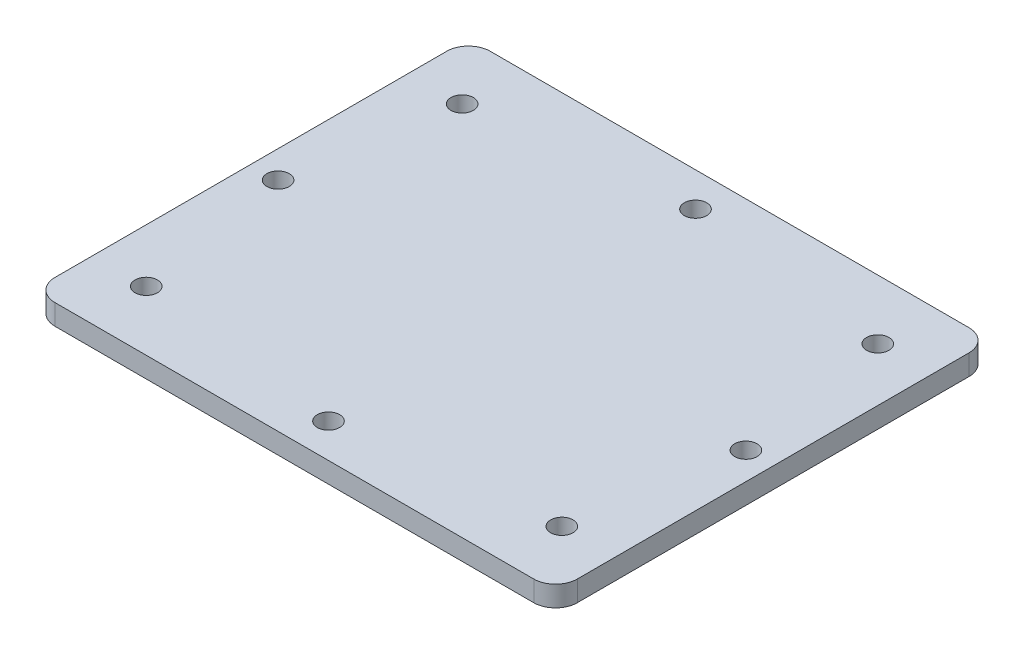
ISO-10303-21;
HEADER;
FILE_DESCRIPTION(('STEP AP214'),'2;1');
FILE_NAME('part.step','',(''),(''),'','','');
FILE_SCHEMA(('AUTOMOTIVE_DESIGN { 1 0 10303 214 1 1 1 1 }'));
ENDSEC;
DATA;
#1=APPLICATION_CONTEXT('core data for automotive mechanical design processes');
#2=APPLICATION_PROTOCOL_DEFINITION('international standard','automotive_design',2000,#1);
#3=PRODUCT_CONTEXT('',#1,'mechanical');
#4=PRODUCT('Part','Part','',(#3));
#5=PRODUCT_RELATED_PRODUCT_CATEGORY('part','',(#4));
#6=PRODUCT_DEFINITION_FORMATION('','',#4);
#7=PRODUCT_DEFINITION_CONTEXT('part definition',#1,'design');
#8=PRODUCT_DEFINITION('design','',#6,#7);
#9=PRODUCT_DEFINITION_SHAPE('','',#8);
#10=(LENGTH_UNIT() NAMED_UNIT(*) SI_UNIT(.MILLI.,.METRE.));
#11=(NAMED_UNIT(*) PLANE_ANGLE_UNIT() SI_UNIT($,.RADIAN.));
#12=(NAMED_UNIT(*) SI_UNIT($,.STERADIAN.) SOLID_ANGLE_UNIT());
#13=UNCERTAINTY_MEASURE_WITH_UNIT(LENGTH_MEASURE(1.E-05),#10,'distance_accuracy_value','');
#14=(GEOMETRIC_REPRESENTATION_CONTEXT(3) GLOBAL_UNCERTAINTY_ASSIGNED_CONTEXT((#13)) GLOBAL_UNIT_ASSIGNED_CONTEXT((#10,
#11,#12)) REPRESENTATION_CONTEXT('',''));
#15=CARTESIAN_POINT('',(0.,0.,0.));
#16=DIRECTION('',(0.,0.,1.));
#17=DIRECTION('',(1.,0.,0.));
#18=AXIS2_PLACEMENT_3D('',#15,#16,#17);
#19=CARTESIAN_POINT('',(38.1,1.5,-31.75));
#20=DIRECTION('',(-1.,0.,0.));
#21=DIRECTION('',(0.,0.,1.));
#22=AXIS2_PLACEMENT_3D('',#19,#20,#21);
#23=PLANE('',#22);
#24=DIRECTION('',(0.,0.,-1.));
#25=VECTOR('',#24,1.);
#26=CARTESIAN_POINT('',(38.1,-1.5,-31.75));
#27=LINE('',#26,#25);
#28=CARTESIAN_POINT('',(38.1,-1.5,28.575));
#29=VERTEX_POINT('',#28);
#30=CARTESIAN_POINT('',(38.1,-1.5,-28.575));
#31=VERTEX_POINT('',#30);
#32=EDGE_CURVE('E154',#29,#31,#27,.T.);
#33=ORIENTED_EDGE('',*,*,#32,.T.);
#34=DIRECTION('',(0.,-1.,0.));
#35=VECTOR('',#34,1.);
#36=CARTESIAN_POINT('',(38.1,1.5,-28.575));
#37=LINE('',#36,#35);
#38=CARTESIAN_POINT('',(38.1,1.5,-28.575));
#39=VERTEX_POINT('',#38);
#40=EDGE_CURVE('E188',#31,#39,#37,.F.);
#41=ORIENTED_EDGE('',*,*,#40,.T.);
#42=DIRECTION('',(0.,0.,-1.));
#43=VECTOR('',#42,1.);
#44=CARTESIAN_POINT('',(38.1,1.5,-31.75));
#45=LINE('',#44,#43);
#46=CARTESIAN_POINT('',(38.1,1.5,28.575));
#47=VERTEX_POINT('',#46);
#48=EDGE_CURVE('E152',#47,#39,#45,.T.);
#49=ORIENTED_EDGE('',*,*,#48,.F.);
#50=DIRECTION('',(0.,-1.,0.));
#51=VECTOR('',#50,1.);
#52=CARTESIAN_POINT('',(38.1,1.5,28.575));
#53=LINE('',#52,#51);
#54=EDGE_CURVE('E184',#47,#29,#53,.T.);
#55=ORIENTED_EDGE('',*,*,#54,.T.);
#56=EDGE_LOOP('',(#33,#41,#49,#55));
#57=FACE_BOUND('',#56,.T.);
#58=ADVANCED_FACE('F51',(#57),#23,.F.);
#59=CARTESIAN_POINT('',(-38.1,1.5,-31.75));
#60=DIRECTION('',(0.,0.,1.));
#61=DIRECTION('',(1.,0.,0.));
#62=AXIS2_PLACEMENT_3D('',#59,#60,#61);
#63=PLANE('',#62);
#64=DIRECTION('',(-1.,0.,0.));
#65=VECTOR('',#64,1.);
#66=CARTESIAN_POINT('',(-38.1,-1.5,-31.75));
#67=LINE('',#66,#65);
#68=CARTESIAN_POINT('',(34.925,-1.5,-31.75));
#69=VERTEX_POINT('',#68);
#70=CARTESIAN_POINT('',(-34.925,-1.5,-31.75));
#71=VERTEX_POINT('',#70);
#72=EDGE_CURVE('E148',#69,#71,#67,.T.);
#73=ORIENTED_EDGE('',*,*,#72,.T.);
#74=DIRECTION('',(0.,-1.,0.));
#75=VECTOR('',#74,1.);
#76=CARTESIAN_POINT('',(-34.925,1.5,-31.75));
#77=LINE('',#76,#75);
#78=CARTESIAN_POINT('',(-34.925,1.5,-31.75));
#79=VERTEX_POINT('',#78);
#80=EDGE_CURVE('E124',#71,#79,#77,.F.);
#81=ORIENTED_EDGE('',*,*,#80,.T.);
#82=DIRECTION('',(-1.,0.,0.));
#83=VECTOR('',#82,1.);
#84=CARTESIAN_POINT('',(-38.1,1.5,-31.75));
#85=LINE('',#84,#83);
#86=CARTESIAN_POINT('',(34.925,1.5,-31.75));
#87=VERTEX_POINT('',#86);
#88=EDGE_CURVE('E260',#87,#79,#85,.T.);
#89=ORIENTED_EDGE('',*,*,#88,.F.);
#90=DIRECTION('',(0.,-1.,0.));
#91=VECTOR('',#90,1.);
#92=CARTESIAN_POINT('',(34.925,1.5,-31.75));
#93=LINE('',#92,#91);
#94=EDGE_CURVE('E130',#87,#69,#93,.T.);
#95=ORIENTED_EDGE('',*,*,#94,.T.);
#96=EDGE_LOOP('',(#73,#81,#89,#95));
#97=FACE_BOUND('',#96,.T.);
#98=ADVANCED_FACE('F281',(#97),#63,.F.);
#99=CARTESIAN_POINT('',(-38.1,1.5,-31.75));
#100=DIRECTION('',(1.,0.,0.));
#101=DIRECTION('',(0.,0.,-1.));
#102=AXIS2_PLACEMENT_3D('',#99,#100,#101);
#103=PLANE('',#102);
#104=DIRECTION('',(0.,0.,1.));
#105=VECTOR('',#104,1.);
#106=CARTESIAN_POINT('',(-38.1,1.5,-31.75));
#107=LINE('',#106,#105);
#108=CARTESIAN_POINT('',(-38.1,1.5,-28.575));
#109=VERTEX_POINT('',#108);
#110=CARTESIAN_POINT('',(-38.1,1.5,28.575));
#111=VERTEX_POINT('',#110);
#112=EDGE_CURVE('E139',#109,#111,#107,.T.);
#113=ORIENTED_EDGE('',*,*,#112,.F.);
#114=DIRECTION('',(0.,-1.,0.));
#115=VECTOR('',#114,1.);
#116=CARTESIAN_POINT('',(-38.1,1.5,-28.575));
#117=LINE('',#116,#115);
#118=CARTESIAN_POINT('',(-38.1,-1.5,-28.575));
#119=VERTEX_POINT('',#118);
#120=EDGE_CURVE('E123',#109,#119,#117,.T.);
#121=ORIENTED_EDGE('',*,*,#120,.T.);
#122=DIRECTION('',(0.,0.,1.));
#123=VECTOR('',#122,1.);
#124=CARTESIAN_POINT('',(-38.1,-1.5,-31.75));
#125=LINE('',#124,#123);
#126=CARTESIAN_POINT('',(-38.1,-1.5,28.575));
#127=VERTEX_POINT('',#126);
#128=EDGE_CURVE('E137',#119,#127,#125,.T.);
#129=ORIENTED_EDGE('',*,*,#128,.T.);
#130=DIRECTION('',(0.,-1.,0.));
#131=VECTOR('',#130,1.);
#132=CARTESIAN_POINT('',(-38.1,1.5,28.575));
#133=LINE('',#132,#131);
#134=EDGE_CURVE('E142',#127,#111,#133,.F.);
#135=ORIENTED_EDGE('',*,*,#134,.T.);
#136=EDGE_LOOP('',(#113,#121,#129,#135));
#137=FACE_BOUND('',#136,.T.);
#138=ADVANCED_FACE('F136',(#137),#103,.F.);
#139=CARTESIAN_POINT('',(-38.1,1.5,31.75));
#140=DIRECTION('',(0.,0.,-1.));
#141=DIRECTION('',(-1.,0.,0.));
#142=AXIS2_PLACEMENT_3D('',#139,#140,#141);
#143=PLANE('',#142);
#144=DIRECTION('',(1.,0.,0.));
#145=VECTOR('',#144,1.);
#146=CARTESIAN_POINT('',(-38.1,-1.5,31.75));
#147=LINE('',#146,#145);
#148=CARTESIAN_POINT('',(-34.925,-1.5,31.75));
#149=VERTEX_POINT('',#148);
#150=CARTESIAN_POINT('',(34.925,-1.5,31.75));
#151=VERTEX_POINT('',#150);
#152=EDGE_CURVE('E147',#149,#151,#147,.T.);
#153=ORIENTED_EDGE('',*,*,#152,.T.);
#154=DIRECTION('',(0.,-1.,0.));
#155=VECTOR('',#154,1.);
#156=CARTESIAN_POINT('',(34.925,1.5,31.75));
#157=LINE('',#156,#155);
#158=CARTESIAN_POINT('',(34.925,1.5,31.75));
#159=VERTEX_POINT('',#158);
#160=EDGE_CURVE('E11',#151,#159,#157,.F.);
#161=ORIENTED_EDGE('',*,*,#160,.T.);
#162=DIRECTION('',(1.,0.,0.));
#163=VECTOR('',#162,1.);
#164=CARTESIAN_POINT('',(-38.1,1.5,31.75));
#165=LINE('',#164,#163);
#166=CARTESIAN_POINT('',(-34.925,1.5,31.75));
#167=VERTEX_POINT('',#166);
#168=EDGE_CURVE('E159',#167,#159,#165,.T.);
#169=ORIENTED_EDGE('',*,*,#168,.F.);
#170=DIRECTION('',(0.,-1.,0.));
#171=VECTOR('',#170,1.);
#172=CARTESIAN_POINT('',(-34.925,1.5,31.75));
#173=LINE('',#172,#171);
#174=EDGE_CURVE('E61',#167,#149,#173,.T.);
#175=ORIENTED_EDGE('',*,*,#174,.T.);
#176=EDGE_LOOP('',(#153,#161,#169,#175));
#177=FACE_BOUND('',#176,.T.);
#178=ADVANCED_FACE('F288',(#177),#143,.F.);
#179=CARTESIAN_POINT('',(0.,1.5,0.));
#180=DIRECTION('',(0.,1.,0.));
#181=DIRECTION('',(0.,0.,1.));
#182=AXIS2_PLACEMENT_3D('',#179,#180,#181);
#183=PLANE('',#182);
#184=CARTESIAN_POINT('',(-34.125,1.5,0.));
#185=DIRECTION('',(0.,1.,0.));
#186=DIRECTION('',(0.,0.,1.));
#187=AXIS2_PLACEMENT_3D('',#184,#185,#186);
#188=CIRCLE('',#187,1.63195);
#189=CARTESIAN_POINT('',(-34.125,1.5,1.63195000000001));
#190=VERTEX_POINT('',#189);
#191=EDGE_CURVE('E239',#190,#190,#188,.T.);
#192=ORIENTED_EDGE('',*,*,#191,.F.);
#193=EDGE_LOOP('',(#192));
#194=FACE_BOUND('',#193,.T.);
#195=CARTESIAN_POINT('',(-30.315,1.5,23.045));
#196=DIRECTION('',(0.,1.,0.));
#197=DIRECTION('',(0.,0.,1.));
#198=AXIS2_PLACEMENT_3D('',#195,#196,#197);
#199=CIRCLE('',#198,1.63195);
#200=CARTESIAN_POINT('',(-30.315,1.5,24.67695));
#201=VERTEX_POINT('',#200);
#202=EDGE_CURVE('E226',#201,#201,#199,.T.);
#203=ORIENTED_EDGE('',*,*,#202,.F.);
#204=EDGE_LOOP('',(#203));
#205=FACE_BOUND('',#204,.T.);
#206=CARTESIAN_POINT('',(0.,1.5,26.77));
#207=DIRECTION('',(0.,1.,0.));
#208=DIRECTION('',(0.,0.,1.));
#209=AXIS2_PLACEMENT_3D('',#206,#207,#208);
#210=CIRCLE('',#209,1.63195);
#211=CARTESIAN_POINT('',(0.,1.5,28.40195));
#212=VERTEX_POINT('',#211);
#213=EDGE_CURVE('E222',#212,#212,#210,.T.);
#214=ORIENTED_EDGE('',*,*,#213,.F.);
#215=EDGE_LOOP('',(#214));
#216=FACE_BOUND('',#215,.T.);
#217=CARTESIAN_POINT('',(30.315,1.5,23.045));
#218=DIRECTION('',(0.,1.,0.));
#219=DIRECTION('',(0.,0.,1.));
#220=AXIS2_PLACEMENT_3D('',#217,#218,#219);
#221=CIRCLE('',#220,1.63195);
#222=CARTESIAN_POINT('',(30.315,1.5,24.67695));
#223=VERTEX_POINT('',#222);
#224=EDGE_CURVE('E218',#223,#223,#221,.T.);
#225=ORIENTED_EDGE('',*,*,#224,.F.);
#226=EDGE_LOOP('',(#225));
#227=FACE_BOUND('',#226,.T.);
#228=CARTESIAN_POINT('',(34.125,1.5,0.));
#229=DIRECTION('',(0.,1.,0.));
#230=DIRECTION('',(0.,0.,1.));
#231=AXIS2_PLACEMENT_3D('',#228,#229,#230);
#232=CIRCLE('',#231,1.63195);
#233=CARTESIAN_POINT('',(34.125,1.5,1.63195000000001));
#234=VERTEX_POINT('',#233);
#235=EDGE_CURVE('E213',#234,#234,#232,.T.);
#236=ORIENTED_EDGE('',*,*,#235,.F.);
#237=EDGE_LOOP('',(#236));
#238=FACE_BOUND('',#237,.T.);
#239=CARTESIAN_POINT('',(30.315,1.5,-23.045));
#240=DIRECTION('',(0.,1.,0.));
#241=DIRECTION('',(0.,0.,1.));
#242=AXIS2_PLACEMENT_3D('',#239,#240,#241);
#243=CIRCLE('',#242,1.63195);
#244=CARTESIAN_POINT('',(30.315,1.5,-21.41305));
#245=VERTEX_POINT('',#244);
#246=EDGE_CURVE('E208',#245,#245,#243,.T.);
#247=ORIENTED_EDGE('',*,*,#246,.F.);
#248=EDGE_LOOP('',(#247));
#249=FACE_BOUND('',#248,.T.);
#250=CARTESIAN_POINT('',(0.,1.5,-26.77));
#251=DIRECTION('',(0.,1.,0.));
#252=DIRECTION('',(0.,0.,1.));
#253=AXIS2_PLACEMENT_3D('',#250,#251,#252);
#254=CIRCLE('',#253,1.63195);
#255=CARTESIAN_POINT('',(0.,1.5,-25.13805));
#256=VERTEX_POINT('',#255);
#257=EDGE_CURVE('E203',#256,#256,#254,.T.);
#258=ORIENTED_EDGE('',*,*,#257,.F.);
#259=EDGE_LOOP('',(#258));
#260=FACE_BOUND('',#259,.T.);
#261=CARTESIAN_POINT('',(-30.315,1.5,-23.045));
#262=DIRECTION('',(0.,1.,0.));
#263=DIRECTION('',(0.,0.,1.));
#264=AXIS2_PLACEMENT_3D('',#261,#262,#263);
#265=CIRCLE('',#264,1.63195);
#266=CARTESIAN_POINT('',(-30.315,1.5,-21.41305));
#267=VERTEX_POINT('',#266);
#268=EDGE_CURVE('E198',#267,#267,#265,.T.);
#269=ORIENTED_EDGE('',*,*,#268,.F.);
#270=EDGE_LOOP('',(#269));
#271=FACE_BOUND('',#270,.T.);
#272=ORIENTED_EDGE('',*,*,#88,.T.);
#273=CARTESIAN_POINT('',(-34.925,1.5,-28.575));
#274=DIRECTION('',(0.,1.,0.));
#275=DIRECTION('',(0.,0.,1.));
#276=AXIS2_PLACEMENT_3D('',#273,#274,#275);
#277=CIRCLE('',#276,3.175);
#278=EDGE_CURVE('E181',#79,#109,#277,.T.);
#279=ORIENTED_EDGE('',*,*,#278,.T.);
#280=ORIENTED_EDGE('',*,*,#112,.T.);
#281=CARTESIAN_POINT('',(-34.925,1.5,28.575));
#282=DIRECTION('',(0.,1.,0.));
#283=DIRECTION('',(0.,0.,1.));
#284=AXIS2_PLACEMENT_3D('',#281,#282,#283);
#285=CIRCLE('',#284,3.175);
#286=EDGE_CURVE('E74',#111,#167,#285,.T.);
#287=ORIENTED_EDGE('',*,*,#286,.T.);
#288=ORIENTED_EDGE('',*,*,#168,.T.);
#289=CARTESIAN_POINT('',(34.925,1.5,28.575));
#290=DIRECTION('',(0.,1.,0.));
#291=DIRECTION('',(0.,0.,1.));
#292=AXIS2_PLACEMENT_3D('',#289,#290,#291);
#293=CIRCLE('',#292,3.175);
#294=EDGE_CURVE('E175',#159,#47,#293,.T.);
#295=ORIENTED_EDGE('',*,*,#294,.T.);
#296=ORIENTED_EDGE('',*,*,#48,.T.);
#297=CARTESIAN_POINT('',(34.925,1.5,-28.575));
#298=DIRECTION('',(0.,1.,0.));
#299=DIRECTION('',(0.,0.,1.));
#300=AXIS2_PLACEMENT_3D('',#297,#298,#299);
#301=CIRCLE('',#300,3.175);
#302=EDGE_CURVE('E178',#39,#87,#301,.T.);
#303=ORIENTED_EDGE('',*,*,#302,.T.);
#304=EDGE_LOOP('',(#272,#279,#280,#287,#288,#295,#296,#303));
#305=FACE_BOUND('',#304,.T.);
#306=ADVANCED_FACE('F279',(#194,#205,#216,#227,#238,#249,#260,#271,#305),#183,.T.);
#307=CARTESIAN_POINT('',(0.,-1.5,0.));
#308=DIRECTION('',(0.,1.,0.));
#309=DIRECTION('',(0.,0.,1.));
#310=AXIS2_PLACEMENT_3D('',#307,#308,#309);
#311=PLANE('',#310);
#312=CARTESIAN_POINT('',(-34.125,-1.5,0.));
#313=DIRECTION('',(0.,1.,0.));
#314=DIRECTION('',(0.,0.,1.));
#315=AXIS2_PLACEMENT_3D('',#312,#313,#314);
#316=CIRCLE('',#315,1.63195);
#317=CARTESIAN_POINT('',(-34.125,-1.5,1.63195000000001));
#318=VERTEX_POINT('',#317);
#319=EDGE_CURVE('E55',#318,#318,#316,.T.);
#320=ORIENTED_EDGE('',*,*,#319,.T.);
#321=EDGE_LOOP('',(#320));
#322=FACE_BOUND('',#321,.T.);
#323=CARTESIAN_POINT('',(-30.315,-1.5,23.045));
#324=DIRECTION('',(0.,1.,0.));
#325=DIRECTION('',(0.,0.,1.));
#326=AXIS2_PLACEMENT_3D('',#323,#324,#325);
#327=CIRCLE('',#326,1.63195);
#328=CARTESIAN_POINT('',(-30.315,-1.5,24.67695));
#329=VERTEX_POINT('',#328);
#330=EDGE_CURVE('E223',#329,#329,#327,.T.);
#331=ORIENTED_EDGE('',*,*,#330,.T.);
#332=EDGE_LOOP('',(#331));
#333=FACE_BOUND('',#332,.T.);
#334=CARTESIAN_POINT('',(0.,-1.5,26.77));
#335=DIRECTION('',(0.,1.,0.));
#336=DIRECTION('',(0.,0.,1.));
#337=AXIS2_PLACEMENT_3D('',#334,#335,#336);
#338=CIRCLE('',#337,1.63195);
#339=CARTESIAN_POINT('',(0.,-1.5,28.40195));
#340=VERTEX_POINT('',#339);
#341=EDGE_CURVE('E219',#340,#340,#338,.T.);
#342=ORIENTED_EDGE('',*,*,#341,.T.);
#343=EDGE_LOOP('',(#342));
#344=FACE_BOUND('',#343,.T.);
#345=CARTESIAN_POINT('',(30.315,-1.5,23.045));
#346=DIRECTION('',(0.,1.,0.));
#347=DIRECTION('',(0.,0.,1.));
#348=AXIS2_PLACEMENT_3D('',#345,#346,#347);
#349=CIRCLE('',#348,1.63195);
#350=CARTESIAN_POINT('',(30.315,-1.5,24.67695));
#351=VERTEX_POINT('',#350);
#352=EDGE_CURVE('E214',#351,#351,#349,.T.);
#353=ORIENTED_EDGE('',*,*,#352,.T.);
#354=EDGE_LOOP('',(#353));
#355=FACE_BOUND('',#354,.T.);
#356=CARTESIAN_POINT('',(34.125,-1.5,0.));
#357=DIRECTION('',(0.,1.,0.));
#358=DIRECTION('',(0.,0.,1.));
#359=AXIS2_PLACEMENT_3D('',#356,#357,#358);
#360=CIRCLE('',#359,1.63195);
#361=CARTESIAN_POINT('',(34.125,-1.5,1.63195000000001));
#362=VERTEX_POINT('',#361);
#363=EDGE_CURVE('E209',#362,#362,#360,.T.);
#364=ORIENTED_EDGE('',*,*,#363,.T.);
#365=EDGE_LOOP('',(#364));
#366=FACE_BOUND('',#365,.T.);
#367=CARTESIAN_POINT('',(30.315,-1.5,-23.045));
#368=DIRECTION('',(0.,1.,0.));
#369=DIRECTION('',(0.,0.,1.));
#370=AXIS2_PLACEMENT_3D('',#367,#368,#369);
#371=CIRCLE('',#370,1.63195);
#372=CARTESIAN_POINT('',(30.315,-1.5,-21.41305));
#373=VERTEX_POINT('',#372);
#374=EDGE_CURVE('E204',#373,#373,#371,.T.);
#375=ORIENTED_EDGE('',*,*,#374,.T.);
#376=EDGE_LOOP('',(#375));
#377=FACE_BOUND('',#376,.T.);
#378=CARTESIAN_POINT('',(0.,-1.5,-26.77));
#379=DIRECTION('',(0.,1.,0.));
#380=DIRECTION('',(0.,0.,1.));
#381=AXIS2_PLACEMENT_3D('',#378,#379,#380);
#382=CIRCLE('',#381,1.63195);
#383=CARTESIAN_POINT('',(0.,-1.5,-25.13805));
#384=VERTEX_POINT('',#383);
#385=EDGE_CURVE('E199',#384,#384,#382,.T.);
#386=ORIENTED_EDGE('',*,*,#385,.T.);
#387=EDGE_LOOP('',(#386));
#388=FACE_BOUND('',#387,.T.);
#389=CARTESIAN_POINT('',(-30.315,-1.5,-23.045));
#390=DIRECTION('',(0.,1.,0.));
#391=DIRECTION('',(0.,0.,1.));
#392=AXIS2_PLACEMENT_3D('',#389,#390,#391);
#393=CIRCLE('',#392,1.63195);
#394=CARTESIAN_POINT('',(-30.315,-1.5,-21.41305));
#395=VERTEX_POINT('',#394);
#396=EDGE_CURVE('E194',#395,#395,#393,.T.);
#397=ORIENTED_EDGE('',*,*,#396,.T.);
#398=EDGE_LOOP('',(#397));
#399=FACE_BOUND('',#398,.T.);
#400=ORIENTED_EDGE('',*,*,#128,.F.);
#401=CARTESIAN_POINT('',(-34.925,-1.5,-28.575));
#402=DIRECTION('',(0.,1.,0.));
#403=DIRECTION('',(0.,0.,1.));
#404=AXIS2_PLACEMENT_3D('',#401,#402,#403);
#405=CIRCLE('',#404,3.175);
#406=EDGE_CURVE('E119',#119,#71,#405,.F.);
#407=ORIENTED_EDGE('',*,*,#406,.T.);
#408=ORIENTED_EDGE('',*,*,#72,.F.);
#409=CARTESIAN_POINT('',(34.925,-1.5,-28.575));
#410=DIRECTION('',(0.,1.,0.));
#411=DIRECTION('',(0.,0.,1.));
#412=AXIS2_PLACEMENT_3D('',#409,#410,#411);
#413=CIRCLE('',#412,3.175);
#414=EDGE_CURVE('E131',#69,#31,#413,.F.);
#415=ORIENTED_EDGE('',*,*,#414,.T.);
#416=ORIENTED_EDGE('',*,*,#32,.F.);
#417=CARTESIAN_POINT('',(34.925,-1.5,28.575));
#418=DIRECTION('',(0.,1.,0.));
#419=DIRECTION('',(0.,0.,1.));
#420=AXIS2_PLACEMENT_3D('',#417,#418,#419);
#421=CIRCLE('',#420,3.175);
#422=EDGE_CURVE('E163',#29,#151,#421,.F.);
#423=ORIENTED_EDGE('',*,*,#422,.T.);
#424=ORIENTED_EDGE('',*,*,#152,.F.);
#425=CARTESIAN_POINT('',(-34.925,-1.5,28.575));
#426=DIRECTION('',(0.,1.,0.));
#427=DIRECTION('',(0.,0.,1.));
#428=AXIS2_PLACEMENT_3D('',#425,#426,#427);
#429=CIRCLE('',#428,3.175);
#430=EDGE_CURVE('E141',#149,#127,#429,.F.);
#431=ORIENTED_EDGE('',*,*,#430,.T.);
#432=EDGE_LOOP('',(#400,#407,#408,#415,#416,#423,#424,#431));
#433=FACE_BOUND('',#432,.T.);
#434=ADVANCED_FACE('F144',(#322,#333,#344,#355,#366,#377,#388,#399,#433),#311,.F.);
#435=CARTESIAN_POINT('',(-34.925,1.5,-28.575));
#436=DIRECTION('',(0.,-1.,0.));
#437=DIRECTION('',(0.,0.,-1.));
#438=AXIS2_PLACEMENT_3D('',#435,#436,#437);
#439=CYLINDRICAL_SURFACE('',#438,3.175);
#440=ORIENTED_EDGE('',*,*,#278,.F.);
#441=ORIENTED_EDGE('',*,*,#80,.F.);
#442=ORIENTED_EDGE('',*,*,#406,.F.);
#443=ORIENTED_EDGE('',*,*,#120,.F.);
#444=EDGE_LOOP('',(#440,#441,#442,#443));
#445=FACE_BOUND('',#444,.T.);
#446=ADVANCED_FACE('F122',(#445),#439,.T.);
#447=CARTESIAN_POINT('',(34.925,1.5,-28.575));
#448=DIRECTION('',(0.,-1.,0.));
#449=DIRECTION('',(0.,0.,-1.));
#450=AXIS2_PLACEMENT_3D('',#447,#448,#449);
#451=CYLINDRICAL_SURFACE('',#450,3.175);
#452=ORIENTED_EDGE('',*,*,#302,.F.);
#453=ORIENTED_EDGE('',*,*,#40,.F.);
#454=ORIENTED_EDGE('',*,*,#414,.F.);
#455=ORIENTED_EDGE('',*,*,#94,.F.);
#456=EDGE_LOOP('',(#452,#453,#454,#455));
#457=FACE_BOUND('',#456,.T.);
#458=ADVANCED_FACE('F276',(#457),#451,.T.);
#459=CARTESIAN_POINT('',(34.925,1.5,28.575));
#460=DIRECTION('',(0.,-1.,0.));
#461=DIRECTION('',(0.,0.,-1.));
#462=AXIS2_PLACEMENT_3D('',#459,#460,#461);
#463=CYLINDRICAL_SURFACE('',#462,3.175);
#464=ORIENTED_EDGE('',*,*,#294,.F.);
#465=ORIENTED_EDGE('',*,*,#160,.F.);
#466=ORIENTED_EDGE('',*,*,#422,.F.);
#467=ORIENTED_EDGE('',*,*,#54,.F.);
#468=EDGE_LOOP('',(#464,#465,#466,#467));
#469=FACE_BOUND('',#468,.T.);
#470=ADVANCED_FACE('F296',(#469),#463,.T.);
#471=CARTESIAN_POINT('',(-34.925,1.5,28.575));
#472=DIRECTION('',(0.,-1.,0.));
#473=DIRECTION('',(0.,0.,-1.));
#474=AXIS2_PLACEMENT_3D('',#471,#472,#473);
#475=CYLINDRICAL_SURFACE('',#474,3.175);
#476=ORIENTED_EDGE('',*,*,#286,.F.);
#477=ORIENTED_EDGE('',*,*,#134,.F.);
#478=ORIENTED_EDGE('',*,*,#430,.F.);
#479=ORIENTED_EDGE('',*,*,#174,.F.);
#480=EDGE_LOOP('',(#476,#477,#478,#479));
#481=FACE_BOUND('',#480,.T.);
#482=ADVANCED_FACE('F53',(#481),#475,.T.);
#483=CARTESIAN_POINT('',(-30.315,1.5,-23.045));
#484=DIRECTION('',(0.,1.,0.));
#485=DIRECTION('',(0.,0.,1.));
#486=AXIS2_PLACEMENT_3D('',#483,#484,#485);
#487=CYLINDRICAL_SURFACE('',#486,1.63195);
#488=ORIENTED_EDGE('',*,*,#268,.T.);
#489=EDGE_LOOP('',(#488));
#490=FACE_BOUND('',#489,.T.);
#491=ORIENTED_EDGE('',*,*,#396,.F.);
#492=EDGE_LOOP('',(#491));
#493=FACE_BOUND('',#492,.T.);
#494=ADVANCED_FACE('F302',(#490,#493),#487,.F.);
#495=CARTESIAN_POINT('',(0.,1.5,-26.77));
#496=DIRECTION('',(0.,1.,0.));
#497=DIRECTION('',(0.,0.,1.));
#498=AXIS2_PLACEMENT_3D('',#495,#496,#497);
#499=CYLINDRICAL_SURFACE('',#498,1.63195);
#500=ORIENTED_EDGE('',*,*,#257,.T.);
#501=EDGE_LOOP('',(#500));
#502=FACE_BOUND('',#501,.T.);
#503=ORIENTED_EDGE('',*,*,#385,.F.);
#504=EDGE_LOOP('',(#503));
#505=FACE_BOUND('',#504,.T.);
#506=ADVANCED_FACE('F318',(#502,#505),#499,.F.);
#507=CARTESIAN_POINT('',(30.315,1.5,-23.045));
#508=DIRECTION('',(0.,1.,0.));
#509=DIRECTION('',(0.,0.,1.));
#510=AXIS2_PLACEMENT_3D('',#507,#508,#509);
#511=CYLINDRICAL_SURFACE('',#510,1.63195);
#512=ORIENTED_EDGE('',*,*,#246,.T.);
#513=EDGE_LOOP('',(#512));
#514=FACE_BOUND('',#513,.T.);
#515=ORIENTED_EDGE('',*,*,#374,.F.);
#516=EDGE_LOOP('',(#515));
#517=FACE_BOUND('',#516,.T.);
#518=ADVANCED_FACE('F322',(#514,#517),#511,.F.);
#519=CARTESIAN_POINT('',(34.125,1.5,0.));
#520=DIRECTION('',(0.,1.,0.));
#521=DIRECTION('',(0.,0.,1.));
#522=AXIS2_PLACEMENT_3D('',#519,#520,#521);
#523=CYLINDRICAL_SURFACE('',#522,1.63195);
#524=ORIENTED_EDGE('',*,*,#235,.T.);
#525=EDGE_LOOP('',(#524));
#526=FACE_BOUND('',#525,.T.);
#527=ORIENTED_EDGE('',*,*,#363,.F.);
#528=EDGE_LOOP('',(#527));
#529=FACE_BOUND('',#528,.T.);
#530=ADVANCED_FACE('F326',(#526,#529),#523,.F.);
#531=CARTESIAN_POINT('',(30.315,1.5,23.045));
#532=DIRECTION('',(0.,1.,0.));
#533=DIRECTION('',(0.,0.,1.));
#534=AXIS2_PLACEMENT_3D('',#531,#532,#533);
#535=CYLINDRICAL_SURFACE('',#534,1.63195);
#536=ORIENTED_EDGE('',*,*,#224,.T.);
#537=EDGE_LOOP('',(#536));
#538=FACE_BOUND('',#537,.T.);
#539=ORIENTED_EDGE('',*,*,#352,.F.);
#540=EDGE_LOOP('',(#539));
#541=FACE_BOUND('',#540,.T.);
#542=ADVANCED_FACE('F330',(#538,#541),#535,.F.);
#543=CARTESIAN_POINT('',(0.,1.5,26.77));
#544=DIRECTION('',(0.,1.,0.));
#545=DIRECTION('',(0.,0.,1.));
#546=AXIS2_PLACEMENT_3D('',#543,#544,#545);
#547=CYLINDRICAL_SURFACE('',#546,1.63195);
#548=ORIENTED_EDGE('',*,*,#213,.T.);
#549=EDGE_LOOP('',(#548));
#550=FACE_BOUND('',#549,.T.);
#551=ORIENTED_EDGE('',*,*,#341,.F.);
#552=EDGE_LOOP('',(#551));
#553=FACE_BOUND('',#552,.T.);
#554=ADVANCED_FACE('F334',(#550,#553),#547,.F.);
#555=CARTESIAN_POINT('',(-30.315,1.5,23.045));
#556=DIRECTION('',(0.,1.,0.));
#557=DIRECTION('',(0.,0.,1.));
#558=AXIS2_PLACEMENT_3D('',#555,#556,#557);
#559=CYLINDRICAL_SURFACE('',#558,1.63195);
#560=ORIENTED_EDGE('',*,*,#202,.T.);
#561=EDGE_LOOP('',(#560));
#562=FACE_BOUND('',#561,.T.);
#563=ORIENTED_EDGE('',*,*,#330,.F.);
#564=EDGE_LOOP('',(#563));
#565=FACE_BOUND('',#564,.T.);
#566=ADVANCED_FACE('F338',(#562,#565),#559,.F.);
#567=CARTESIAN_POINT('',(-34.125,1.5,0.));
#568=DIRECTION('',(0.,1.,0.));
#569=DIRECTION('',(0.,0.,1.));
#570=AXIS2_PLACEMENT_3D('',#567,#568,#569);
#571=CYLINDRICAL_SURFACE('',#570,1.63195);
#572=ORIENTED_EDGE('',*,*,#191,.T.);
#573=EDGE_LOOP('',(#572));
#574=FACE_BOUND('',#573,.T.);
#575=ORIENTED_EDGE('',*,*,#319,.F.);
#576=EDGE_LOOP('',(#575));
#577=FACE_BOUND('',#576,.T.);
#578=ADVANCED_FACE('F342',(#574,#577),#571,.F.);
#579=CLOSED_SHELL('',(#58,#98,#138,#178,#306,#434,#446,#458,#470,#482,#494,#506,#518,#530,#542,
#554,#566,#578));
#580=MANIFOLD_SOLID_BREP('B2',#579);
#581=ADVANCED_BREP_SHAPE_REPRESENTATION('',(#18,#580),#14);
#582=SHAPE_DEFINITION_REPRESENTATION(#9,#581);
ENDSEC;
END-ISO-10303-21;
